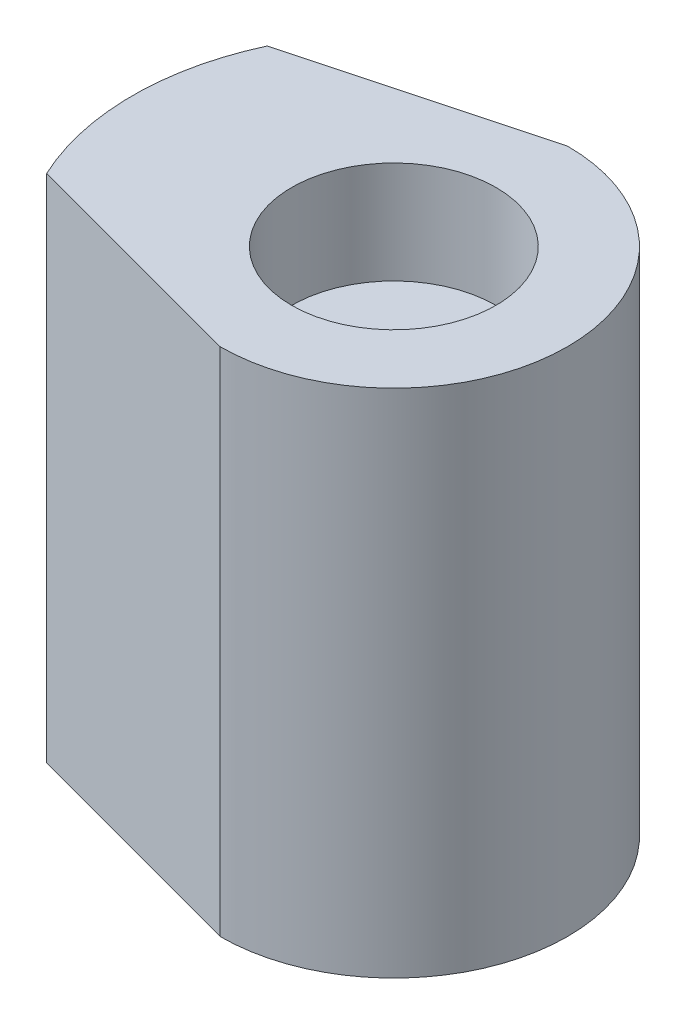
ISO-10303-21;
HEADER;
FILE_DESCRIPTION(('STEP AP214'),'2;1');
FILE_NAME('part.step','',(''),(''),'','','');
FILE_SCHEMA(('AUTOMOTIVE_DESIGN { 1 0 10303 214 1 1 1 1 }'));
ENDSEC;
DATA;
#1=APPLICATION_CONTEXT('core data for automotive mechanical design processes');
#2=APPLICATION_PROTOCOL_DEFINITION('international standard','automotive_design',2000,#1);
#3=PRODUCT_CONTEXT('',#1,'mechanical');
#4=PRODUCT('Part','Part','',(#3));
#5=PRODUCT_RELATED_PRODUCT_CATEGORY('part','',(#4));
#6=PRODUCT_DEFINITION_FORMATION('','',#4);
#7=PRODUCT_DEFINITION_CONTEXT('part definition',#1,'design');
#8=PRODUCT_DEFINITION('design','',#6,#7);
#9=PRODUCT_DEFINITION_SHAPE('','',#8);
#10=(LENGTH_UNIT() NAMED_UNIT(*) SI_UNIT(.MILLI.,.METRE.));
#11=(NAMED_UNIT(*) PLANE_ANGLE_UNIT() SI_UNIT($,.RADIAN.));
#12=(NAMED_UNIT(*) SI_UNIT($,.STERADIAN.) SOLID_ANGLE_UNIT());
#13=UNCERTAINTY_MEASURE_WITH_UNIT(LENGTH_MEASURE(1.E-05),#10,'distance_accuracy_value','');
#14=(GEOMETRIC_REPRESENTATION_CONTEXT(3) GLOBAL_UNCERTAINTY_ASSIGNED_CONTEXT((#13)) GLOBAL_UNIT_ASSIGNED_CONTEXT((#10,
#11,#12)) REPRESENTATION_CONTEXT('',''));
#15=CARTESIAN_POINT('',(0.,0.,0.));
#16=DIRECTION('',(0.,0.,1.));
#17=DIRECTION('',(1.,0.,0.));
#18=AXIS2_PLACEMENT_3D('',#15,#16,#17);
#19=CARTESIAN_POINT('',(-2.12499999999998,5.,-7.93060796608388));
#20=DIRECTION('',(0.258819045102518,0.,0.965925826289069));
#21=DIRECTION('',(0.965925826289069,0.,-0.258819045102518));
#22=AXIS2_PLACEMENT_3D('',#19,#20,#21);
#23=PLANE('',#22);
#24=DIRECTION('',(0.,-1.,0.));
#25=VECTOR('',#24,1.);
#26=CARTESIAN_POINT('',(0.,5.,-8.5));
#27=LINE('',#26,#25);
#28=CARTESIAN_POINT('',(0.,5.,-8.5));
#29=VERTEX_POINT('',#28);
#30=CARTESIAN_POINT('',(0.,-20.,-8.5));
#31=VERTEX_POINT('',#30);
#32=EDGE_CURVE('E84',#29,#31,#27,.T.);
#33=ORIENTED_EDGE('',*,*,#32,.T.);
#34=DIRECTION('',(0.965925826289069,0.,-0.258819045102518));
#35=VECTOR('',#34,1.);
#36=CARTESIAN_POINT('',(-2.12499999999998,-20.,-7.93060796608388));
#37=LINE('',#36,#35);
#38=CARTESIAN_POINT('',(-11.5911099154688,-20.,-5.39417145876979));
#39=VERTEX_POINT('',#38);
#40=EDGE_CURVE('E87',#39,#31,#37,.T.);
#41=ORIENTED_EDGE('',*,*,#40,.F.);
#42=DIRECTION('',(0.,-1.,0.));
#43=VECTOR('',#42,1.);
#44=CARTESIAN_POINT('',(-11.5911099154688,5.,-5.39417145876978));
#45=LINE('',#44,#43);
#46=CARTESIAN_POINT('',(-11.5911099154688,5.,-5.39417145876978));
#47=VERTEX_POINT('',#46);
#48=EDGE_CURVE('E11',#47,#39,#45,.T.);
#49=ORIENTED_EDGE('',*,*,#48,.F.);
#50=DIRECTION('',(-0.965925826289069,0.,0.258819045102518));
#51=VECTOR('',#50,1.);
#52=CARTESIAN_POINT('',(-2.12499999999998,5.,-7.93060796608388));
#53=LINE('',#52,#51);
#54=EDGE_CURVE('E88',#29,#47,#53,.T.);
#55=ORIENTED_EDGE('',*,*,#54,.F.);
#56=EDGE_LOOP('',(#33,#41,#49,#55));
#57=FACE_BOUND('',#56,.T.);
#58=ADVANCED_FACE('F43',(#57),#23,.F.);
#59=CARTESIAN_POINT('',(0.,5.,0.));
#60=DIRECTION('',(0.,-1.,0.));
#61=DIRECTION('',(0.,0.,-1.));
#62=AXIS2_PLACEMENT_3D('',#59,#60,#61);
#63=CYLINDRICAL_SURFACE('',#62,12.7847923252232);
#64=ORIENTED_EDGE('',*,*,#48,.T.);
#65=CARTESIAN_POINT('',(0.,-20.,0.));
#66=DIRECTION('',(0.,-1.,0.));
#67=DIRECTION('',(0.,0.,-1.));
#68=AXIS2_PLACEMENT_3D('',#65,#66,#67);
#69=CIRCLE('',#68,12.7847923252232);
#70=CARTESIAN_POINT('',(-11.5911099154688,-20.,5.39417145876978));
#71=VERTEX_POINT('',#70);
#72=EDGE_CURVE('E100',#71,#39,#69,.T.);
#73=ORIENTED_EDGE('',*,*,#72,.F.);
#74=DIRECTION('',(0.,-1.,0.));
#75=VECTOR('',#74,1.);
#76=CARTESIAN_POINT('',(-11.5911099154688,5.,5.39417145876978));
#77=LINE('',#76,#75);
#78=CARTESIAN_POINT('',(-11.5911099154688,5.,5.39417145876978));
#79=VERTEX_POINT('',#78);
#80=EDGE_CURVE('E50',#79,#71,#77,.T.);
#81=ORIENTED_EDGE('',*,*,#80,.F.);
#82=CARTESIAN_POINT('',(0.,5.,0.));
#83=DIRECTION('',(0.,1.,0.));
#84=DIRECTION('',(0.,0.,1.));
#85=AXIS2_PLACEMENT_3D('',#82,#83,#84);
#86=CIRCLE('',#85,12.7847923252232);
#87=EDGE_CURVE('E110',#47,#79,#86,.T.);
#88=ORIENTED_EDGE('',*,*,#87,.F.);
#89=EDGE_LOOP('',(#64,#73,#81,#88));
#90=FACE_BOUND('',#89,.T.);
#91=ADVANCED_FACE('F122',(#90),#63,.T.);
#92=CARTESIAN_POINT('',(-2.12499999999998,5.,7.93060796608388));
#93=DIRECTION('',(-0.258819045102518,0.,0.965925826289069));
#94=DIRECTION('',(0.965925826289069,0.,0.258819045102518));
#95=AXIS2_PLACEMENT_3D('',#92,#93,#94);
#96=PLANE('',#95);
#97=ORIENTED_EDGE('',*,*,#80,.T.);
#98=DIRECTION('',(-0.965925826289069,0.,-0.258819045102518));
#99=VECTOR('',#98,1.);
#100=CARTESIAN_POINT('',(-2.12499999999998,-20.,7.93060796608388));
#101=LINE('',#100,#99);
#102=CARTESIAN_POINT('',(0.,-20.,8.5));
#103=VERTEX_POINT('',#102);
#104=EDGE_CURVE('E104',#103,#71,#101,.T.);
#105=ORIENTED_EDGE('',*,*,#104,.F.);
#106=DIRECTION('',(0.,-1.,0.));
#107=VECTOR('',#106,1.);
#108=CARTESIAN_POINT('',(0.,5.,8.5));
#109=LINE('',#108,#107);
#110=CARTESIAN_POINT('',(0.,5.,8.5));
#111=VERTEX_POINT('',#110);
#112=EDGE_CURVE('E65',#111,#103,#109,.T.);
#113=ORIENTED_EDGE('',*,*,#112,.F.);
#114=DIRECTION('',(-0.965925826289069,0.,-0.258819045102518));
#115=VECTOR('',#114,1.);
#116=CARTESIAN_POINT('',(-2.12499999999998,5.,7.93060796608388));
#117=LINE('',#116,#115);
#118=EDGE_CURVE('E112',#111,#79,#117,.T.);
#119=ORIENTED_EDGE('',*,*,#118,.T.);
#120=EDGE_LOOP('',(#97,#105,#113,#119));
#121=FACE_BOUND('',#120,.T.);
#122=ADVANCED_FACE('F120',(#121),#96,.T.);
#123=CARTESIAN_POINT('',(0.,5.,0.));
#124=DIRECTION('',(0.,-1.,0.));
#125=DIRECTION('',(0.,0.,-1.));
#126=AXIS2_PLACEMENT_3D('',#123,#124,#125);
#127=CYLINDRICAL_SURFACE('',#126,8.5);
#128=ORIENTED_EDGE('',*,*,#112,.T.);
#129=CARTESIAN_POINT('',(0.,-20.,0.));
#130=DIRECTION('',(0.,1.,0.));
#131=DIRECTION('',(0.,0.,1.));
#132=AXIS2_PLACEMENT_3D('',#129,#130,#131);
#133=CIRCLE('',#132,8.5);
#134=EDGE_CURVE('E98',#103,#31,#133,.T.);
#135=ORIENTED_EDGE('',*,*,#134,.T.);
#136=ORIENTED_EDGE('',*,*,#32,.F.);
#137=CARTESIAN_POINT('',(0.,5.,0.));
#138=DIRECTION('',(0.,1.,0.));
#139=DIRECTION('',(0.,0.,1.));
#140=AXIS2_PLACEMENT_3D('',#137,#138,#139);
#141=CIRCLE('',#140,8.5);
#142=EDGE_CURVE('E57',#111,#29,#141,.T.);
#143=ORIENTED_EDGE('',*,*,#142,.F.);
#144=EDGE_LOOP('',(#128,#135,#136,#143));
#145=FACE_BOUND('',#144,.T.);
#146=ADVANCED_FACE('F103',(#145),#127,.T.);
#147=CARTESIAN_POINT('',(0.,5.,0.));
#148=DIRECTION('',(0.,-1.,0.));
#149=DIRECTION('',(0.,0.,-1.));
#150=AXIS2_PLACEMENT_3D('',#147,#148,#149);
#151=CYLINDRICAL_SURFACE('',#150,5.);
#152=CARTESIAN_POINT('',(0.,5.,0.));
#153=DIRECTION('',(0.,1.,0.));
#154=DIRECTION('',(0.,0.,1.));
#155=AXIS2_PLACEMENT_3D('',#152,#153,#154);
#156=CIRCLE('',#155,5.);
#157=CARTESIAN_POINT('',(0.,5.,5.));
#158=VERTEX_POINT('',#157);
#159=EDGE_CURVE('E91',#158,#158,#156,.T.);
#160=ORIENTED_EDGE('',*,*,#159,.T.);
#161=EDGE_LOOP('',(#160));
#162=FACE_BOUND('',#161,.T.);
#163=CARTESIAN_POINT('',(0.,0.,0.));
#164=DIRECTION('',(0.,1.,0.));
#165=DIRECTION('',(0.,0.,1.));
#166=AXIS2_PLACEMENT_3D('',#163,#164,#165);
#167=CIRCLE('',#166,5.);
#168=CARTESIAN_POINT('',(0.,0.,5.));
#169=VERTEX_POINT('',#168);
#170=EDGE_CURVE('E101',#169,#169,#167,.T.);
#171=ORIENTED_EDGE('',*,*,#170,.F.);
#172=EDGE_LOOP('',(#171));
#173=FACE_BOUND('',#172,.T.);
#174=ADVANCED_FACE('F126',(#162,#173),#151,.F.);
#175=CARTESIAN_POINT('',(0.,5.,0.));
#176=DIRECTION('',(0.,1.,0.));
#177=DIRECTION('',(0.,0.,1.));
#178=AXIS2_PLACEMENT_3D('',#175,#176,#177);
#179=PLANE('',#178);
#180=ORIENTED_EDGE('',*,*,#54,.T.);
#181=ORIENTED_EDGE('',*,*,#87,.T.);
#182=ORIENTED_EDGE('',*,*,#118,.F.);
#183=ORIENTED_EDGE('',*,*,#142,.T.);
#184=EDGE_LOOP('',(#180,#181,#182,#183));
#185=FACE_BOUND('',#184,.T.);
#186=ORIENTED_EDGE('',*,*,#159,.F.);
#187=EDGE_LOOP('',(#186));
#188=FACE_BOUND('',#187,.T.);
#189=ADVANCED_FACE('F123',(#185,#188),#179,.T.);
#190=CARTESIAN_POINT('',(0.,-20.,0.));
#191=DIRECTION('',(0.,-1.,0.));
#192=DIRECTION('',(0.,0.,-1.));
#193=AXIS2_PLACEMENT_3D('',#190,#191,#192);
#194=PLANE('',#193);
#195=ORIENTED_EDGE('',*,*,#40,.T.);
#196=ORIENTED_EDGE('',*,*,#134,.F.);
#197=ORIENTED_EDGE('',*,*,#104,.T.);
#198=ORIENTED_EDGE('',*,*,#72,.T.);
#199=EDGE_LOOP('',(#195,#196,#197,#198));
#200=FACE_BOUND('',#199,.T.);
#201=ADVANCED_FACE('F96',(#200),#194,.T.);
#202=CARTESIAN_POINT('',(0.,0.,0.));
#203=DIRECTION('',(0.,1.,0.));
#204=DIRECTION('',(0.,0.,1.));
#205=AXIS2_PLACEMENT_3D('',#202,#203,#204);
#206=PLANE('',#205);
#207=ORIENTED_EDGE('',*,*,#170,.T.);
#208=EDGE_LOOP('',(#207));
#209=FACE_BOUND('',#208,.T.);
#210=ADVANCED_FACE('F135',(#209),#206,.T.);
#211=CLOSED_SHELL('',(#58,#91,#122,#146,#174,#189,#201,#210));
#212=MANIFOLD_SOLID_BREP('B2',#211);
#213=ADVANCED_BREP_SHAPE_REPRESENTATION('',(#18,#212),#14);
#214=SHAPE_DEFINITION_REPRESENTATION(#9,#213);
ENDSEC;
END-ISO-10303-21;
